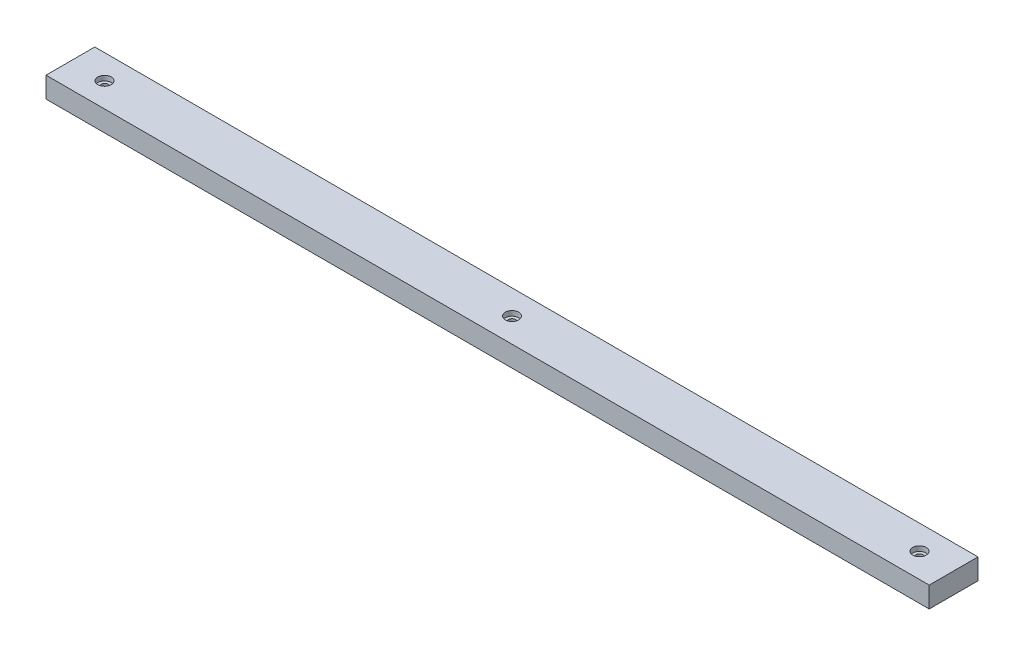
ISO-10303-21;
HEADER;
FILE_DESCRIPTION(('STEP AP214'),'2;1');
FILE_NAME('part.step','',(''),(''),'','','');
FILE_SCHEMA(('AUTOMOTIVE_DESIGN { 1 0 10303 214 1 1 1 1 }'));
ENDSEC;
DATA;
#1=APPLICATION_CONTEXT('core data for automotive mechanical design processes');
#2=APPLICATION_PROTOCOL_DEFINITION('international standard','automotive_design',2000,#1);
#3=PRODUCT_CONTEXT('',#1,'mechanical');
#4=PRODUCT('Part','Part','',(#3));
#5=PRODUCT_RELATED_PRODUCT_CATEGORY('part','',(#4));
#6=PRODUCT_DEFINITION_FORMATION('','',#4);
#7=PRODUCT_DEFINITION_CONTEXT('part definition',#1,'design');
#8=PRODUCT_DEFINITION('design','',#6,#7);
#9=PRODUCT_DEFINITION_SHAPE('','',#8);
#10=(LENGTH_UNIT() NAMED_UNIT(*) SI_UNIT(.MILLI.,.METRE.));
#11=(NAMED_UNIT(*) PLANE_ANGLE_UNIT() SI_UNIT($,.RADIAN.));
#12=(NAMED_UNIT(*) SI_UNIT($,.STERADIAN.) SOLID_ANGLE_UNIT());
#13=UNCERTAINTY_MEASURE_WITH_UNIT(LENGTH_MEASURE(1.E-05),#10,'distance_accuracy_value','');
#14=(GEOMETRIC_REPRESENTATION_CONTEXT(3) GLOBAL_UNCERTAINTY_ASSIGNED_CONTEXT((#13)) GLOBAL_UNIT_ASSIGNED_CONTEXT((#10,
#11,#12)) REPRESENTATION_CONTEXT('',''));
#15=CARTESIAN_POINT('',(0.,0.,0.));
#16=DIRECTION('',(0.,0.,1.));
#17=DIRECTION('',(1.,0.,0.));
#18=AXIS2_PLACEMENT_3D('',#15,#16,#17);
#19=CARTESIAN_POINT('',(-181.,0.,20.));
#20=DIRECTION('',(1.,0.,0.));
#21=DIRECTION('',(0.,0.,-1.));
#22=AXIS2_PLACEMENT_3D('',#19,#20,#21);
#23=PLANE('',#22);
#24=DIRECTION('',(0.,-1.,0.));
#25=VECTOR('',#24,1.);
#26=CARTESIAN_POINT('',(-181.,0.,0.));
#27=LINE('',#26,#25);
#28=CARTESIAN_POINT('',(-181.,0.,0.));
#29=VERTEX_POINT('',#28);
#30=CARTESIAN_POINT('',(-181.,-8.5,0.));
#31=VERTEX_POINT('',#30);
#32=EDGE_CURVE('E95',#29,#31,#27,.T.);
#33=ORIENTED_EDGE('',*,*,#32,.T.);
#34=DIRECTION('',(0.,0.,-1.));
#35=VECTOR('',#34,1.);
#36=CARTESIAN_POINT('',(-181.,-8.5,20.));
#37=LINE('',#36,#35);
#38=CARTESIAN_POINT('',(-181.,-8.5,20.));
#39=VERTEX_POINT('',#38);
#40=EDGE_CURVE('E11',#39,#31,#37,.T.);
#41=ORIENTED_EDGE('',*,*,#40,.F.);
#42=DIRECTION('',(0.,-1.,0.));
#43=VECTOR('',#42,1.);
#44=CARTESIAN_POINT('',(-181.,0.,20.));
#45=LINE('',#44,#43);
#46=CARTESIAN_POINT('',(-181.,0.,20.));
#47=VERTEX_POINT('',#46);
#48=EDGE_CURVE('E83',#47,#39,#45,.T.);
#49=ORIENTED_EDGE('',*,*,#48,.F.);
#50=DIRECTION('',(0.,0.,-1.));
#51=VECTOR('',#50,1.);
#52=CARTESIAN_POINT('',(-181.,0.,20.));
#53=LINE('',#52,#51);
#54=EDGE_CURVE('E91',#47,#29,#53,.T.);
#55=ORIENTED_EDGE('',*,*,#54,.T.);
#56=EDGE_LOOP('',(#33,#41,#49,#55));
#57=FACE_BOUND('',#56,.T.);
#58=ADVANCED_FACE('F32',(#57),#23,.F.);
#59=CARTESIAN_POINT('',(-181.,-8.5,20.));
#60=DIRECTION('',(0.,1.,0.));
#61=DIRECTION('',(0.,0.,1.));
#62=AXIS2_PLACEMENT_3D('',#59,#60,#61);
#63=PLANE('',#62);
#64=CARTESIAN_POINT('',(-167.,-8.5,10.));
#65=DIRECTION('',(0.,1.,0.));
#66=DIRECTION('',(0.,0.,1.));
#67=AXIS2_PLACEMENT_3D('',#64,#65,#66);
#68=CIRCLE('',#67,1.5);
#69=CARTESIAN_POINT('',(-167.,-8.5,11.5));
#70=VERTEX_POINT('',#69);
#71=EDGE_CURVE('E132',#70,#70,#68,.T.);
#72=ORIENTED_EDGE('',*,*,#71,.T.);
#73=EDGE_LOOP('',(#72));
#74=FACE_BOUND('',#73,.T.);
#75=CARTESIAN_POINT('',(167.,-8.5,10.));
#76=DIRECTION('',(0.,1.,0.));
#77=DIRECTION('',(0.,0.,1.));
#78=AXIS2_PLACEMENT_3D('',#75,#76,#77);
#79=CIRCLE('',#78,1.5);
#80=CARTESIAN_POINT('',(167.,-8.5,11.5));
#81=VERTEX_POINT('',#80);
#82=EDGE_CURVE('E120',#81,#81,#79,.T.);
#83=ORIENTED_EDGE('',*,*,#82,.T.);
#84=EDGE_LOOP('',(#83));
#85=FACE_BOUND('',#84,.T.);
#86=CARTESIAN_POINT('',(0.,-8.5,10.));
#87=DIRECTION('',(0.,1.,0.));
#88=DIRECTION('',(0.,0.,1.));
#89=AXIS2_PLACEMENT_3D('',#86,#87,#88);
#90=CIRCLE('',#89,1.5);
#91=CARTESIAN_POINT('',(0.,-8.5,11.5));
#92=VERTEX_POINT('',#91);
#93=EDGE_CURVE('E98',#92,#92,#90,.T.);
#94=ORIENTED_EDGE('',*,*,#93,.T.);
#95=EDGE_LOOP('',(#94));
#96=FACE_BOUND('',#95,.T.);
#97=DIRECTION('',(1.,0.,0.));
#98=VECTOR('',#97,1.);
#99=CARTESIAN_POINT('',(-181.,-8.5,0.));
#100=LINE('',#99,#98);
#101=CARTESIAN_POINT('',(181.,-8.5,0.));
#102=VERTEX_POINT('',#101);
#103=EDGE_CURVE('E87',#31,#102,#100,.T.);
#104=ORIENTED_EDGE('',*,*,#103,.T.);
#105=DIRECTION('',(0.,0.,-1.));
#106=VECTOR('',#105,1.);
#107=CARTESIAN_POINT('',(181.,-8.5,20.));
#108=LINE('',#107,#106);
#109=CARTESIAN_POINT('',(181.,-8.5,20.));
#110=VERTEX_POINT('',#109);
#111=EDGE_CURVE('E40',#110,#102,#108,.T.);
#112=ORIENTED_EDGE('',*,*,#111,.F.);
#113=DIRECTION('',(1.,0.,0.));
#114=VECTOR('',#113,1.);
#115=CARTESIAN_POINT('',(-181.,-8.5,20.));
#116=LINE('',#115,#114);
#117=EDGE_CURVE('E78',#39,#110,#116,.T.);
#118=ORIENTED_EDGE('',*,*,#117,.F.);
#119=ORIENTED_EDGE('',*,*,#40,.T.);
#120=EDGE_LOOP('',(#104,#112,#118,#119));
#121=FACE_BOUND('',#120,.T.);
#122=ADVANCED_FACE('F86',(#74,#85,#96,#121),#63,.F.);
#123=CARTESIAN_POINT('',(181.,-8.5,20.));
#124=DIRECTION('',(-1.,0.,0.));
#125=DIRECTION('',(0.,0.,1.));
#126=AXIS2_PLACEMENT_3D('',#123,#124,#125);
#127=PLANE('',#126);
#128=DIRECTION('',(0.,1.,0.));
#129=VECTOR('',#128,1.);
#130=CARTESIAN_POINT('',(181.,-8.5,0.));
#131=LINE('',#130,#129);
#132=CARTESIAN_POINT('',(181.,0.,0.));
#133=VERTEX_POINT('',#132);
#134=EDGE_CURVE('E65',#102,#133,#131,.T.);
#135=ORIENTED_EDGE('',*,*,#134,.T.);
#136=DIRECTION('',(0.,0.,-1.));
#137=VECTOR('',#136,1.);
#138=CARTESIAN_POINT('',(181.,0.,20.));
#139=LINE('',#138,#137);
#140=CARTESIAN_POINT('',(181.,0.,20.));
#141=VERTEX_POINT('',#140);
#142=EDGE_CURVE('E88',#141,#133,#139,.T.);
#143=ORIENTED_EDGE('',*,*,#142,.F.);
#144=DIRECTION('',(0.,1.,0.));
#145=VECTOR('',#144,1.);
#146=CARTESIAN_POINT('',(181.,-8.5,20.));
#147=LINE('',#146,#145);
#148=EDGE_CURVE('E81',#110,#141,#147,.T.);
#149=ORIENTED_EDGE('',*,*,#148,.F.);
#150=ORIENTED_EDGE('',*,*,#111,.T.);
#151=EDGE_LOOP('',(#135,#143,#149,#150));
#152=FACE_BOUND('',#151,.T.);
#153=ADVANCED_FACE('F89',(#152),#127,.F.);
#154=CARTESIAN_POINT('',(181.,0.,20.));
#155=DIRECTION('',(0.,-1.,0.));
#156=DIRECTION('',(0.,0.,-1.));
#157=AXIS2_PLACEMENT_3D('',#154,#155,#156);
#158=PLANE('',#157);
#159=CARTESIAN_POINT('',(-167.,0.,10.));
#160=DIRECTION('',(0.,1.,0.));
#161=DIRECTION('',(0.,0.,1.));
#162=AXIS2_PLACEMENT_3D('',#159,#160,#161);
#163=CIRCLE('',#162,2.75);
#164=CARTESIAN_POINT('',(-167.,0.,12.75));
#165=VERTEX_POINT('',#164);
#166=EDGE_CURVE('E141',#165,#165,#163,.T.);
#167=ORIENTED_EDGE('',*,*,#166,.F.);
#168=EDGE_LOOP('',(#167));
#169=FACE_BOUND('',#168,.T.);
#170=CARTESIAN_POINT('',(167.,0.,10.));
#171=DIRECTION('',(0.,1.,0.));
#172=DIRECTION('',(0.,0.,1.));
#173=AXIS2_PLACEMENT_3D('',#170,#171,#172);
#174=CIRCLE('',#173,2.75);
#175=CARTESIAN_POINT('',(167.,0.,12.75));
#176=VERTEX_POINT('',#175);
#177=EDGE_CURVE('E129',#176,#176,#174,.T.);
#178=ORIENTED_EDGE('',*,*,#177,.F.);
#179=EDGE_LOOP('',(#178));
#180=FACE_BOUND('',#179,.T.);
#181=CARTESIAN_POINT('',(0.,0.,10.));
#182=DIRECTION('',(0.,1.,0.));
#183=DIRECTION('',(0.,0.,1.));
#184=AXIS2_PLACEMENT_3D('',#181,#182,#183);
#185=CIRCLE('',#184,2.75);
#186=CARTESIAN_POINT('',(0.,0.,12.75));
#187=VERTEX_POINT('',#186);
#188=EDGE_CURVE('E117',#187,#187,#185,.T.);
#189=ORIENTED_EDGE('',*,*,#188,.F.);
#190=EDGE_LOOP('',(#189));
#191=FACE_BOUND('',#190,.T.);
#192=DIRECTION('',(-1.,0.,0.));
#193=VECTOR('',#192,1.);
#194=CARTESIAN_POINT('',(181.,0.,0.));
#195=LINE('',#194,#193);
#196=EDGE_CURVE('E71',#133,#29,#195,.T.);
#197=ORIENTED_EDGE('',*,*,#196,.T.);
#198=ORIENTED_EDGE('',*,*,#54,.F.);
#199=DIRECTION('',(-1.,0.,0.));
#200=VECTOR('',#199,1.);
#201=CARTESIAN_POINT('',(181.,0.,20.));
#202=LINE('',#201,#200);
#203=EDGE_CURVE('E48',#141,#47,#202,.T.);
#204=ORIENTED_EDGE('',*,*,#203,.F.);
#205=ORIENTED_EDGE('',*,*,#142,.T.);
#206=EDGE_LOOP('',(#197,#198,#204,#205));
#207=FACE_BOUND('',#206,.T.);
#208=ADVANCED_FACE('F103',(#169,#180,#191,#207),#158,.F.);
#209=CARTESIAN_POINT('',(0.,0.,20.));
#210=DIRECTION('',(0.,0.,1.));
#211=DIRECTION('',(1.,0.,0.));
#212=AXIS2_PLACEMENT_3D('',#209,#210,#211);
#213=PLANE('',#212);
#214=ORIENTED_EDGE('',*,*,#48,.T.);
#215=ORIENTED_EDGE('',*,*,#117,.T.);
#216=ORIENTED_EDGE('',*,*,#148,.T.);
#217=ORIENTED_EDGE('',*,*,#203,.T.);
#218=EDGE_LOOP('',(#214,#215,#216,#217));
#219=FACE_BOUND('',#218,.T.);
#220=ADVANCED_FACE('F79',(#219),#213,.T.);
#221=CARTESIAN_POINT('',(0.,0.,0.));
#222=DIRECTION('',(0.,0.,1.));
#223=DIRECTION('',(1.,0.,0.));
#224=AXIS2_PLACEMENT_3D('',#221,#222,#223);
#225=PLANE('',#224);
#226=ORIENTED_EDGE('',*,*,#32,.F.);
#227=ORIENTED_EDGE('',*,*,#196,.F.);
#228=ORIENTED_EDGE('',*,*,#134,.F.);
#229=ORIENTED_EDGE('',*,*,#103,.F.);
#230=EDGE_LOOP('',(#226,#227,#228,#229));
#231=FACE_BOUND('',#230,.T.);
#232=ADVANCED_FACE('F106',(#231),#225,.F.);
#233=CARTESIAN_POINT('',(0.,0.,10.));
#234=DIRECTION('',(0.,1.,0.));
#235=DIRECTION('',(0.,0.,1.));
#236=AXIS2_PLACEMENT_3D('',#233,#234,#235);
#237=CYLINDRICAL_SURFACE('',#236,1.5);
#238=ORIENTED_EDGE('',*,*,#93,.F.);
#239=EDGE_LOOP('',(#238));
#240=FACE_BOUND('',#239,.T.);
#241=CARTESIAN_POINT('',(0.,-2.,10.));
#242=DIRECTION('',(0.,1.,0.));
#243=DIRECTION('',(0.,0.,1.));
#244=AXIS2_PLACEMENT_3D('',#241,#242,#243);
#245=CIRCLE('',#244,1.50000000000001);
#246=CARTESIAN_POINT('',(0.,-2.,11.5));
#247=VERTEX_POINT('',#246);
#248=EDGE_CURVE('E111',#247,#247,#245,.T.);
#249=ORIENTED_EDGE('',*,*,#248,.T.);
#250=EDGE_LOOP('',(#249));
#251=FACE_BOUND('',#250,.T.);
#252=ADVANCED_FACE('F167',(#240,#251),#237,.F.);
#253=CARTESIAN_POINT('',(1.50000000000007,-2.,10.));
#254=DIRECTION('',(0.,-1.,0.));
#255=DIRECTION('',(0.,0.,-1.));
#256=AXIS2_PLACEMENT_3D('',#253,#254,#255);
#257=PLANE('',#256);
#258=ORIENTED_EDGE('',*,*,#248,.F.);
#259=EDGE_LOOP('',(#258));
#260=FACE_BOUND('',#259,.T.);
#261=CARTESIAN_POINT('',(0.,-2.,10.));
#262=DIRECTION('',(0.,1.,0.));
#263=DIRECTION('',(0.,0.,1.));
#264=AXIS2_PLACEMENT_3D('',#261,#262,#263);
#265=CIRCLE('',#264,2.75);
#266=CARTESIAN_POINT('',(0.,-2.,12.75));
#267=VERTEX_POINT('',#266);
#268=EDGE_CURVE('E114',#267,#267,#265,.T.);
#269=ORIENTED_EDGE('',*,*,#268,.T.);
#270=EDGE_LOOP('',(#269));
#271=FACE_BOUND('',#270,.T.);
#272=ADVANCED_FACE('F157',(#260,#271),#257,.F.);
#273=CARTESIAN_POINT('',(0.,0.,10.));
#274=DIRECTION('',(0.,1.,0.));
#275=DIRECTION('',(0.,0.,1.));
#276=AXIS2_PLACEMENT_3D('',#273,#274,#275);
#277=CYLINDRICAL_SURFACE('',#276,2.75);
#278=ORIENTED_EDGE('',*,*,#268,.F.);
#279=EDGE_LOOP('',(#278));
#280=FACE_BOUND('',#279,.T.);
#281=ORIENTED_EDGE('',*,*,#188,.T.);
#282=EDGE_LOOP('',(#281));
#283=FACE_BOUND('',#282,.T.);
#284=ADVANCED_FACE('F154',(#280,#283),#277,.F.);
#285=CARTESIAN_POINT('',(167.,0.,10.));
#286=DIRECTION('',(0.,1.,0.));
#287=DIRECTION('',(0.,0.,1.));
#288=AXIS2_PLACEMENT_3D('',#285,#286,#287);
#289=CYLINDRICAL_SURFACE('',#288,1.5);
#290=ORIENTED_EDGE('',*,*,#82,.F.);
#291=EDGE_LOOP('',(#290));
#292=FACE_BOUND('',#291,.T.);
#293=CARTESIAN_POINT('',(167.,-2.,10.));
#294=DIRECTION('',(0.,1.,0.));
#295=DIRECTION('',(0.,0.,1.));
#296=AXIS2_PLACEMENT_3D('',#293,#294,#295);
#297=CIRCLE('',#296,1.5);
#298=CARTESIAN_POINT('',(167.,-2.,11.5));
#299=VERTEX_POINT('',#298);
#300=EDGE_CURVE('E123',#299,#299,#297,.T.);
#301=ORIENTED_EDGE('',*,*,#300,.T.);
#302=EDGE_LOOP('',(#301));
#303=FACE_BOUND('',#302,.T.);
#304=ADVANCED_FACE('F156',(#292,#303),#289,.F.);
#305=CARTESIAN_POINT('',(168.5,-2.,10.));
#306=DIRECTION('',(0.,-1.,0.));
#307=DIRECTION('',(0.,0.,-1.));
#308=AXIS2_PLACEMENT_3D('',#305,#306,#307);
#309=PLANE('',#308);
#310=ORIENTED_EDGE('',*,*,#300,.F.);
#311=EDGE_LOOP('',(#310));
#312=FACE_BOUND('',#311,.T.);
#313=CARTESIAN_POINT('',(167.,-2.,10.));
#314=DIRECTION('',(0.,1.,0.));
#315=DIRECTION('',(0.,0.,1.));
#316=AXIS2_PLACEMENT_3D('',#313,#314,#315);
#317=CIRCLE('',#316,2.75);
#318=CARTESIAN_POINT('',(167.,-2.,12.75));
#319=VERTEX_POINT('',#318);
#320=EDGE_CURVE('E126',#319,#319,#317,.T.);
#321=ORIENTED_EDGE('',*,*,#320,.T.);
#322=EDGE_LOOP('',(#321));
#323=FACE_BOUND('',#322,.T.);
#324=ADVANCED_FACE('F164',(#312,#323),#309,.F.);
#325=CARTESIAN_POINT('',(167.,0.,10.));
#326=DIRECTION('',(0.,1.,0.));
#327=DIRECTION('',(0.,0.,1.));
#328=AXIS2_PLACEMENT_3D('',#325,#326,#327);
#329=CYLINDRICAL_SURFACE('',#328,2.75);
#330=ORIENTED_EDGE('',*,*,#320,.F.);
#331=EDGE_LOOP('',(#330));
#332=FACE_BOUND('',#331,.T.);
#333=ORIENTED_EDGE('',*,*,#177,.T.);
#334=EDGE_LOOP('',(#333));
#335=FACE_BOUND('',#334,.T.);
#336=ADVANCED_FACE('F221',(#332,#335),#329,.F.);
#337=CARTESIAN_POINT('',(-167.,0.,10.));
#338=DIRECTION('',(0.,1.,0.));
#339=DIRECTION('',(0.,0.,1.));
#340=AXIS2_PLACEMENT_3D('',#337,#338,#339);
#341=CYLINDRICAL_SURFACE('',#340,1.5);
#342=ORIENTED_EDGE('',*,*,#71,.F.);
#343=EDGE_LOOP('',(#342));
#344=FACE_BOUND('',#343,.T.);
#345=CARTESIAN_POINT('',(-167.,-2.,10.));
#346=DIRECTION('',(0.,1.,0.));
#347=DIRECTION('',(0.,0.,1.));
#348=AXIS2_PLACEMENT_3D('',#345,#346,#347);
#349=CIRCLE('',#348,1.5);
#350=CARTESIAN_POINT('',(-167.,-2.,11.5));
#351=VERTEX_POINT('',#350);
#352=EDGE_CURVE('E135',#351,#351,#349,.T.);
#353=ORIENTED_EDGE('',*,*,#352,.T.);
#354=EDGE_LOOP('',(#353));
#355=FACE_BOUND('',#354,.T.);
#356=ADVANCED_FACE('F231',(#344,#355),#341,.F.);
#357=CARTESIAN_POINT('',(-165.5,-2.,10.));
#358=DIRECTION('',(0.,-1.,0.));
#359=DIRECTION('',(0.,0.,-1.));
#360=AXIS2_PLACEMENT_3D('',#357,#358,#359);
#361=PLANE('',#360);
#362=ORIENTED_EDGE('',*,*,#352,.F.);
#363=EDGE_LOOP('',(#362));
#364=FACE_BOUND('',#363,.T.);
#365=CARTESIAN_POINT('',(-167.,-2.,10.));
#366=DIRECTION('',(0.,1.,0.));
#367=DIRECTION('',(0.,0.,1.));
#368=AXIS2_PLACEMENT_3D('',#365,#366,#367);
#369=CIRCLE('',#368,2.75);
#370=CARTESIAN_POINT('',(-167.,-2.,12.75));
#371=VERTEX_POINT('',#370);
#372=EDGE_CURVE('E138',#371,#371,#369,.T.);
#373=ORIENTED_EDGE('',*,*,#372,.T.);
#374=EDGE_LOOP('',(#373));
#375=FACE_BOUND('',#374,.T.);
#376=ADVANCED_FACE('F241',(#364,#375),#361,.F.);
#377=CARTESIAN_POINT('',(-167.,0.,10.));
#378=DIRECTION('',(0.,1.,0.));
#379=DIRECTION('',(0.,0.,1.));
#380=AXIS2_PLACEMENT_3D('',#377,#378,#379);
#381=CYLINDRICAL_SURFACE('',#380,2.75);
#382=ORIENTED_EDGE('',*,*,#372,.F.);
#383=EDGE_LOOP('',(#382));
#384=FACE_BOUND('',#383,.T.);
#385=ORIENTED_EDGE('',*,*,#166,.T.);
#386=EDGE_LOOP('',(#385));
#387=FACE_BOUND('',#386,.T.);
#388=ADVANCED_FACE('F145',(#384,#387),#381,.F.);
#389=CLOSED_SHELL('',(#58,#122,#153,#208,#220,#232,#252,#272,#284,#304,#324,#336,#356,#376,#388));
#390=MANIFOLD_SOLID_BREP('B2',#389);
#391=ADVANCED_BREP_SHAPE_REPRESENTATION('',(#18,#390),#14);
#392=SHAPE_DEFINITION_REPRESENTATION(#9,#391);
ENDSEC;
END-ISO-10303-21;
